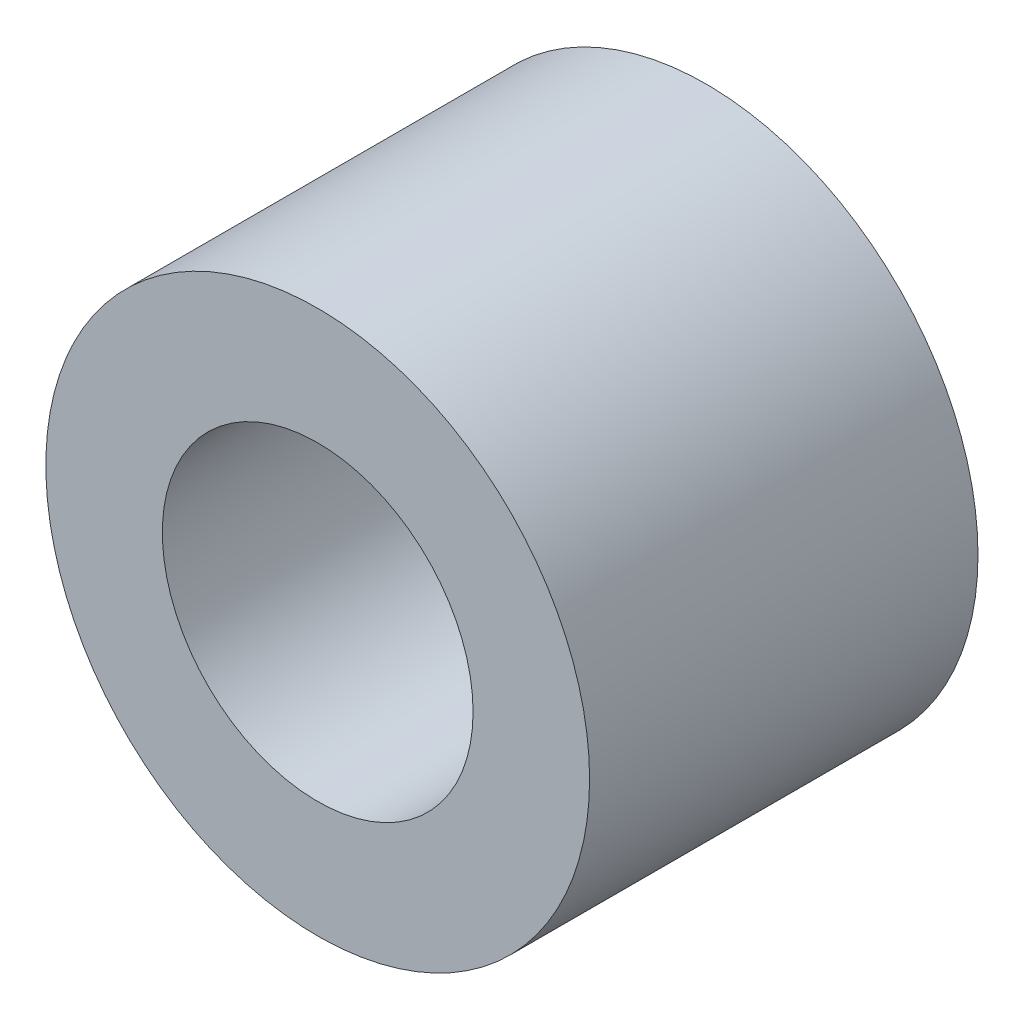
ISO-10303-21;
HEADER;
FILE_DESCRIPTION(('STEP AP214'),'2;1');
FILE_NAME('part.step','',(''),(''),'','','');
FILE_SCHEMA(('AUTOMOTIVE_DESIGN { 1 0 10303 214 1 1 1 1 }'));
ENDSEC;
DATA;
#1=APPLICATION_CONTEXT('core data for automotive mechanical design processes');
#2=APPLICATION_PROTOCOL_DEFINITION('international standard','automotive_design',2000,#1);
#3=PRODUCT_CONTEXT('',#1,'mechanical');
#4=PRODUCT('Part','Part','',(#3));
#5=PRODUCT_RELATED_PRODUCT_CATEGORY('part','',(#4));
#6=PRODUCT_DEFINITION_FORMATION('','',#4);
#7=PRODUCT_DEFINITION_CONTEXT('part definition',#1,'design');
#8=PRODUCT_DEFINITION('design','',#6,#7);
#9=PRODUCT_DEFINITION_SHAPE('','',#8);
#10=(LENGTH_UNIT() NAMED_UNIT(*) SI_UNIT(.MILLI.,.METRE.));
#11=(NAMED_UNIT(*) PLANE_ANGLE_UNIT() SI_UNIT($,.RADIAN.));
#12=(NAMED_UNIT(*) SI_UNIT($,.STERADIAN.) SOLID_ANGLE_UNIT());
#13=UNCERTAINTY_MEASURE_WITH_UNIT(LENGTH_MEASURE(1.E-05),#10,'distance_accuracy_value','');
#14=(GEOMETRIC_REPRESENTATION_CONTEXT(3) GLOBAL_UNCERTAINTY_ASSIGNED_CONTEXT((#13)) GLOBAL_UNIT_ASSIGNED_CONTEXT((#10,
#11,#12)) REPRESENTATION_CONTEXT('',''));
#15=CARTESIAN_POINT('',(0.,0.,0.));
#16=DIRECTION('',(0.,0.,1.));
#17=DIRECTION('',(1.,0.,0.));
#18=AXIS2_PLACEMENT_3D('',#15,#16,#17);
#19=CARTESIAN_POINT('',(0.,0.,10.));
#20=DIRECTION('',(0.,0.,1.));
#21=DIRECTION('',(1.,0.,0.));
#22=AXIS2_PLACEMENT_3D('',#19,#20,#21);
#23=PLANE('',#22);
#24=CARTESIAN_POINT('',(0.,0.,10.));
#25=DIRECTION('',(0.,0.,1.));
#26=DIRECTION('',(1.,0.,0.));
#27=AXIS2_PLACEMENT_3D('',#24,#25,#26);
#28=CIRCLE('',#27,7.);
#29=CARTESIAN_POINT('',(7.,0.,10.));
#30=VERTEX_POINT('',#29);
#31=EDGE_CURVE('E10',#30,#30,#28,.T.);
#32=ORIENTED_EDGE('',*,*,#31,.T.);
#33=EDGE_LOOP('',(#32));
#34=FACE_BOUND('',#33,.T.);
#35=CARTESIAN_POINT('',(0.,0.,10.));
#36=DIRECTION('',(0.,0.,1.));
#37=DIRECTION('',(1.,0.,0.));
#38=AXIS2_PLACEMENT_3D('',#35,#36,#37);
#39=CIRCLE('',#38,4.);
#40=CARTESIAN_POINT('',(4.,0.,10.));
#41=VERTEX_POINT('',#40);
#42=EDGE_CURVE('E41',#41,#41,#39,.T.);
#43=ORIENTED_EDGE('',*,*,#42,.F.);
#44=EDGE_LOOP('',(#43));
#45=FACE_BOUND('',#44,.T.);
#46=ADVANCED_FACE('F30',(#34,#45),#23,.T.);
#47=CARTESIAN_POINT('',(0.,0.,0.));
#48=DIRECTION('',(0.,0.,1.));
#49=DIRECTION('',(1.,0.,0.));
#50=AXIS2_PLACEMENT_3D('',#47,#48,#49);
#51=PLANE('',#50);
#52=CARTESIAN_POINT('',(0.,0.,0.));
#53=DIRECTION('',(0.,0.,1.));
#54=DIRECTION('',(1.,0.,0.));
#55=AXIS2_PLACEMENT_3D('',#52,#53,#54);
#56=CIRCLE('',#55,7.);
#57=CARTESIAN_POINT('',(7.,0.,0.));
#58=VERTEX_POINT('',#57);
#59=EDGE_CURVE('E34',#58,#58,#56,.T.);
#60=ORIENTED_EDGE('',*,*,#59,.F.);
#61=EDGE_LOOP('',(#60));
#62=FACE_BOUND('',#61,.T.);
#63=CARTESIAN_POINT('',(0.,0.,0.));
#64=DIRECTION('',(0.,0.,1.));
#65=DIRECTION('',(1.,0.,0.));
#66=AXIS2_PLACEMENT_3D('',#63,#64,#65);
#67=CIRCLE('',#66,4.);
#68=CARTESIAN_POINT('',(4.,0.,0.));
#69=VERTEX_POINT('',#68);
#70=EDGE_CURVE('E43',#69,#69,#67,.T.);
#71=ORIENTED_EDGE('',*,*,#70,.T.);
#72=EDGE_LOOP('',(#71));
#73=FACE_BOUND('',#72,.T.);
#74=ADVANCED_FACE('F53',(#62,#73),#51,.F.);
#75=CARTESIAN_POINT('',(0.,0.,10.));
#76=DIRECTION('',(0.,0.,-1.));
#77=DIRECTION('',(-1.,0.,0.));
#78=AXIS2_PLACEMENT_3D('',#75,#76,#77);
#79=CYLINDRICAL_SURFACE('',#78,7.);
#80=ORIENTED_EDGE('',*,*,#31,.F.);
#81=EDGE_LOOP('',(#80));
#82=FACE_BOUND('',#81,.T.);
#83=ORIENTED_EDGE('',*,*,#59,.T.);
#84=EDGE_LOOP('',(#83));
#85=FACE_BOUND('',#84,.T.);
#86=ADVANCED_FACE('F32',(#82,#85),#79,.T.);
#87=CARTESIAN_POINT('',(0.,0.,10.));
#88=DIRECTION('',(0.,0.,-1.));
#89=DIRECTION('',(-1.,0.,0.));
#90=AXIS2_PLACEMENT_3D('',#87,#88,#89);
#91=CYLINDRICAL_SURFACE('',#90,4.);
#92=ORIENTED_EDGE('',*,*,#42,.T.);
#93=EDGE_LOOP('',(#92));
#94=FACE_BOUND('',#93,.T.);
#95=ORIENTED_EDGE('',*,*,#70,.F.);
#96=EDGE_LOOP('',(#95));
#97=FACE_BOUND('',#96,.T.);
#98=ADVANCED_FACE('F49',(#94,#97),#91,.F.);
#99=CLOSED_SHELL('',(#46,#74,#86,#98));
#100=MANIFOLD_SOLID_BREP('B2',#99);
#101=ADVANCED_BREP_SHAPE_REPRESENTATION('',(#18,#100),#14);
#102=SHAPE_DEFINITION_REPRESENTATION(#9,#101);
ENDSEC;
END-ISO-10303-21;
